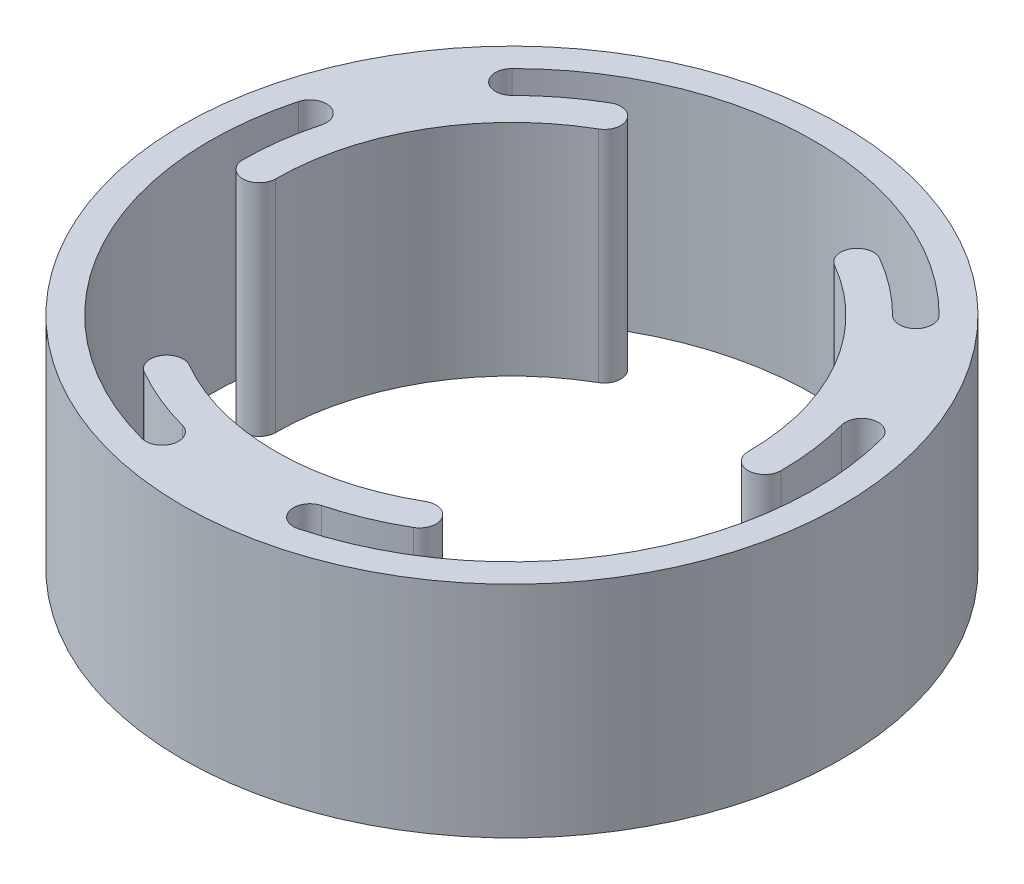
ISO-10303-21;
HEADER;
FILE_DESCRIPTION(('STEP AP214'),'2;1');
FILE_NAME('part.step','',(''),(''),'','','');
FILE_SCHEMA(('AUTOMOTIVE_DESIGN { 1 0 10303 214 1 1 1 1 }'));
ENDSEC;
DATA;
#1=APPLICATION_CONTEXT('core data for automotive mechanical design processes');
#2=APPLICATION_PROTOCOL_DEFINITION('international standard','automotive_design',2000,#1);
#3=PRODUCT_CONTEXT('',#1,'mechanical');
#4=PRODUCT('Part','Part','',(#3));
#5=PRODUCT_RELATED_PRODUCT_CATEGORY('part','',(#4));
#6=PRODUCT_DEFINITION_FORMATION('','',#4);
#7=PRODUCT_DEFINITION_CONTEXT('part definition',#1,'design');
#8=PRODUCT_DEFINITION('design','',#6,#7);
#9=PRODUCT_DEFINITION_SHAPE('','',#8);
#10=(LENGTH_UNIT() NAMED_UNIT(*) SI_UNIT(.MILLI.,.METRE.));
#11=(NAMED_UNIT(*) PLANE_ANGLE_UNIT() SI_UNIT($,.RADIAN.));
#12=(NAMED_UNIT(*) SI_UNIT($,.STERADIAN.) SOLID_ANGLE_UNIT());
#13=UNCERTAINTY_MEASURE_WITH_UNIT(LENGTH_MEASURE(1.E-05),#10,'distance_accuracy_value','');
#14=(GEOMETRIC_REPRESENTATION_CONTEXT(3) GLOBAL_UNCERTAINTY_ASSIGNED_CONTEXT((#13)) GLOBAL_UNIT_ASSIGNED_CONTEXT((#10,
#11,#12)) REPRESENTATION_CONTEXT('',''));
#15=CARTESIAN_POINT('',(0.,0.,0.));
#16=DIRECTION('',(0.,0.,1.));
#17=DIRECTION('',(1.,0.,0.));
#18=AXIS2_PLACEMENT_3D('',#15,#16,#17);
#19=CARTESIAN_POINT('',(0.,0.,0.));
#20=DIRECTION('',(0.,1.,0.));
#21=DIRECTION('',(0.,0.,1.));
#22=AXIS2_PLACEMENT_3D('',#19,#20,#21);
#23=PLANE('',#22);
#24=CARTESIAN_POINT('',(0.,0.,0.));
#25=DIRECTION('',(0.,1.,0.));
#26=DIRECTION('',(0.,0.,1.));
#27=AXIS2_PLACEMENT_3D('',#24,#25,#26);
#28=CIRCLE('',#27,30.);
#29=CARTESIAN_POINT('',(0.,0.,30.));
#30=VERTEX_POINT('',#29);
#31=EDGE_CURVE('E41',#30,#30,#28,.T.);
#32=ORIENTED_EDGE('',*,*,#31,.F.);
#33=EDGE_LOOP('',(#32));
#34=FACE_BOUND('',#33,.T.);
#35=CARTESIAN_POINT('',(18.3847763108503,0.,-18.3847763108502));
#36=DIRECTION('',(0.,1.,0.));
#37=DIRECTION('',(0.,0.,1.));
#38=AXIS2_PLACEMENT_3D('',#35,#36,#37);
#39=CIRCLE('',#38,1.5);
#40=CARTESIAN_POINT('',(19.4454364826301,0.,-19.44543648263));
#41=VERTEX_POINT('',#40);
#42=CARTESIAN_POINT('',(17.3241161390705,0.,-17.3241161390704));
#43=VERTEX_POINT('',#42);
#44=EDGE_CURVE('E267',#41,#43,#39,.F.);
#45=ORIENTED_EDGE('',*,*,#44,.F.);
#46=CARTESIAN_POINT('',(0.,0.,0.));
#47=DIRECTION('',(0.,1.,0.));
#48=DIRECTION('',(0.,0.,1.));
#49=AXIS2_PLACEMENT_3D('',#46,#47,#48);
#50=CIRCLE('',#49,27.5);
#51=CARTESIAN_POINT('',(-19.4454364826301,0.,-19.44543648263));
#52=VERTEX_POINT('',#51);
#53=EDGE_CURVE('E269',#52,#41,#50,.F.);
#54=ORIENTED_EDGE('',*,*,#53,.F.);
#55=CARTESIAN_POINT('',(-18.3847763108503,0.,-18.3847763108502));
#56=DIRECTION('',(0.,1.,0.));
#57=DIRECTION('',(0.,0.,1.));
#58=AXIS2_PLACEMENT_3D('',#55,#56,#57);
#59=CIRCLE('',#58,1.5);
#60=CARTESIAN_POINT('',(-17.3241161390705,0.,-17.3241161390704));
#61=VERTEX_POINT('',#60);
#62=EDGE_CURVE('E260',#61,#52,#59,.F.);
#63=ORIENTED_EDGE('',*,*,#62,.F.);
#64=CARTESIAN_POINT('',(0.,0.,0.));
#65=DIRECTION('',(0.,1.,0.));
#66=DIRECTION('',(0.,0.,1.));
#67=AXIS2_PLACEMENT_3D('',#64,#65,#66);
#68=CIRCLE('',#67,24.5);
#69=CARTESIAN_POINT('',(-12.2499999999999,0.,-21.2176223927188));
#70=VERTEX_POINT('',#69);
#71=EDGE_CURVE('E262',#70,#61,#68,.T.);
#72=ORIENTED_EDGE('',*,*,#71,.F.);
#73=CARTESIAN_POINT('',(-11.4999999999999,0.,-19.9185842870422));
#74=DIRECTION('',(0.,1.,0.));
#75=DIRECTION('',(0.,0.,1.));
#76=AXIS2_PLACEMENT_3D('',#73,#74,#75);
#77=CIRCLE('',#76,1.5);
#78=CARTESIAN_POINT('',(-10.7499999999999,0.,-18.6195461813655));
#79=VERTEX_POINT('',#78);
#80=EDGE_CURVE('E344',#79,#70,#77,.T.);
#81=ORIENTED_EDGE('',*,*,#80,.F.);
#82=CARTESIAN_POINT('',(0.,0.,0.));
#83=DIRECTION('',(0.,-1.,0.));
#84=DIRECTION('',(0.,0.,1.));
#85=AXIS2_PLACEMENT_3D('',#82,#83,#84);
#86=CIRCLE('',#85,21.5);
#87=CARTESIAN_POINT('',(-21.5,0.,-2.06291908745145E-13));
#88=VERTEX_POINT('',#87);
#89=EDGE_CURVE('E349',#88,#79,#86,.T.);
#90=ORIENTED_EDGE('',*,*,#89,.F.);
#91=CARTESIAN_POINT('',(-23.,0.,-2.21038701180133E-13));
#92=DIRECTION('',(0.,1.,0.));
#93=DIRECTION('',(0.,0.,1.));
#94=AXIS2_PLACEMENT_3D('',#91,#92,#93);
#95=CIRCLE('',#94,1.5);
#96=CARTESIAN_POINT('',(-24.5,0.,-2.35454268648402E-13));
#97=VERTEX_POINT('',#96);
#98=EDGE_CURVE('E222',#97,#88,#95,.T.);
#99=ORIENTED_EDGE('',*,*,#98,.F.);
#100=CARTESIAN_POINT('',(0.,0.,0.));
#101=DIRECTION('',(0.,1.,0.));
#102=DIRECTION('',(0.,0.,1.));
#103=AXIS2_PLACEMENT_3D('',#100,#101,#102);
#104=CIRCLE('',#103,24.5);
#105=CARTESIAN_POINT('',(-23.6651827440822,0.,-6.34106660501178));
#106=VERTEX_POINT('',#105);
#107=EDGE_CURVE('E212',#106,#97,#104,.T.);
#108=ORIENTED_EDGE('',*,*,#107,.F.);
#109=CARTESIAN_POINT('',(-25.1140714835158,0.,-6.72929517266559));
#110=DIRECTION('',(0.,1.,0.));
#111=DIRECTION('',(0.,0.,1.));
#112=AXIS2_PLACEMENT_3D('',#109,#110,#111);
#113=CIRCLE('',#112,1.5);
#114=CARTESIAN_POINT('',(-26.5629602229494,0.,-7.11752374031936));
#115=VERTEX_POINT('',#114);
#116=EDGE_CURVE('E198',#115,#106,#113,.F.);
#117=ORIENTED_EDGE('',*,*,#116,.F.);
#118=CARTESIAN_POINT('',(0.,0.,0.));
#119=DIRECTION('',(0.,1.,0.));
#120=DIRECTION('',(0.,0.,1.));
#121=AXIS2_PLACEMENT_3D('',#118,#119,#120);
#122=CIRCLE('',#121,27.5);
#123=CARTESIAN_POINT('',(-7.11752374031927,0.,26.5629602229494));
#124=VERTEX_POINT('',#123);
#125=EDGE_CURVE('E207',#124,#115,#122,.F.);
#126=ORIENTED_EDGE('',*,*,#125,.F.);
#127=CARTESIAN_POINT('',(-6.7292951726655,0.,25.1140714835158));
#128=DIRECTION('',(0.,1.,0.));
#129=DIRECTION('',(0.,0.,1.));
#130=AXIS2_PLACEMENT_3D('',#127,#128,#129);
#131=CIRCLE('',#130,1.5);
#132=CARTESIAN_POINT('',(-6.34106660501165,0.,23.6651827440822));
#133=VERTEX_POINT('',#132);
#134=EDGE_CURVE('E217',#133,#124,#131,.F.);
#135=ORIENTED_EDGE('',*,*,#134,.F.);
#136=CARTESIAN_POINT('',(-12.2500000000001,0.,21.2176223927187));
#137=VERTEX_POINT('',#136);
#138=EDGE_CURVE('E206',#137,#133,#104,.T.);
#139=ORIENTED_EDGE('',*,*,#138,.F.);
#140=CARTESIAN_POINT('',(-11.5000000000001,0.,19.918584287042));
#141=DIRECTION('',(0.,1.,0.));
#142=DIRECTION('',(0.,0.,1.));
#143=AXIS2_PLACEMENT_3D('',#140,#141,#142);
#144=CIRCLE('',#143,1.5);
#145=CARTESIAN_POINT('',(-10.7500000000001,0.,18.6195461813654));
#146=VERTEX_POINT('',#145);
#147=EDGE_CURVE('E332',#146,#137,#144,.T.);
#148=ORIENTED_EDGE('',*,*,#147,.F.);
#149=CARTESIAN_POINT('',(0.,0.,0.));
#150=DIRECTION('',(0.,-1.,0.));
#151=DIRECTION('',(0.,0.,1.));
#152=AXIS2_PLACEMENT_3D('',#149,#150,#151);
#153=CIRCLE('',#152,21.5);
#154=CARTESIAN_POINT('',(10.7499999999998,0.,18.6195461813655));
#155=VERTEX_POINT('',#154);
#156=EDGE_CURVE('E322',#155,#146,#153,.T.);
#157=ORIENTED_EDGE('',*,*,#156,.F.);
#158=CARTESIAN_POINT('',(11.4999999999998,0.,19.9185842870422));
#159=DIRECTION('',(0.,1.,0.));
#160=DIRECTION('',(0.,0.,1.));
#161=AXIS2_PLACEMENT_3D('',#158,#159,#160);
#162=CIRCLE('',#161,1.5);
#163=CARTESIAN_POINT('',(12.2499999999998,0.,21.2176223927189));
#164=VERTEX_POINT('',#163);
#165=EDGE_CURVE('E339',#164,#155,#162,.T.);
#166=ORIENTED_EDGE('',*,*,#165,.F.);
#167=CARTESIAN_POINT('',(0.,0.,0.));
#168=DIRECTION('',(0.,1.,0.));
#169=DIRECTION('',(0.,0.,1.));
#170=AXIS2_PLACEMENT_3D('',#167,#168,#169);
#171=CIRCLE('',#170,24.5);
#172=CARTESIAN_POINT('',(6.34106660501176,0.,23.6651827440822));
#173=VERTEX_POINT('',#172);
#174=EDGE_CURVE('E256',#173,#164,#171,.T.);
#175=ORIENTED_EDGE('',*,*,#174,.F.);
#176=CARTESIAN_POINT('',(6.7292951726655,0.,25.1140714835158));
#177=DIRECTION('',(0.,1.,0.));
#178=DIRECTION('',(0.,0.,1.));
#179=AXIS2_PLACEMENT_3D('',#176,#177,#178);
#180=CIRCLE('',#179,1.5);
#181=CARTESIAN_POINT('',(7.11752374031928,0.,26.5629602229494));
#182=VERTEX_POINT('',#181);
#183=EDGE_CURVE('E229',#182,#173,#180,.F.);
#184=ORIENTED_EDGE('',*,*,#183,.F.);
#185=CARTESIAN_POINT('',(0.,0.,0.));
#186=DIRECTION('',(0.,1.,0.));
#187=DIRECTION('',(0.,0.,1.));
#188=AXIS2_PLACEMENT_3D('',#185,#186,#187);
#189=CIRCLE('',#188,27.5);
#190=CARTESIAN_POINT('',(26.5629602229494,0.,-7.11752374031937));
#191=VERTEX_POINT('',#190);
#192=EDGE_CURVE('E227',#191,#182,#189,.F.);
#193=ORIENTED_EDGE('',*,*,#192,.F.);
#194=CARTESIAN_POINT('',(25.1140714835158,0.,-6.72929517266559));
#195=DIRECTION('',(0.,1.,0.));
#196=DIRECTION('',(0.,0.,1.));
#197=AXIS2_PLACEMENT_3D('',#194,#195,#196);
#198=CIRCLE('',#197,1.5);
#199=CARTESIAN_POINT('',(23.6651827440822,0.,-6.34106660501185));
#200=VERTEX_POINT('',#199);
#201=EDGE_CURVE('E240',#200,#191,#198,.F.);
#202=ORIENTED_EDGE('',*,*,#201,.F.);
#203=CARTESIAN_POINT('',(24.5,0.,1.33219235306974E-13));
#204=VERTEX_POINT('',#203);
#205=EDGE_CURVE('E255',#204,#200,#171,.T.);
#206=ORIENTED_EDGE('',*,*,#205,.F.);
#207=CARTESIAN_POINT('',(23.,0.,1.25062955594302E-13));
#208=DIRECTION('',(0.,1.,0.));
#209=DIRECTION('',(0.,0.,1.));
#210=AXIS2_PLACEMENT_3D('',#207,#208,#209);
#211=CIRCLE('',#210,1.5);
#212=CARTESIAN_POINT('',(21.5,0.,1.158915114504E-13));
#213=VERTEX_POINT('',#212);
#214=EDGE_CURVE('E306',#213,#204,#211,.T.);
#215=ORIENTED_EDGE('',*,*,#214,.F.);
#216=CARTESIAN_POINT('',(0.,0.,0.));
#217=DIRECTION('',(0.,-1.,0.));
#218=DIRECTION('',(0.,0.,1.));
#219=AXIS2_PLACEMENT_3D('',#216,#217,#218);
#220=CIRCLE('',#219,21.5);
#221=CARTESIAN_POINT('',(10.7500000000002,0.,-18.6195461813653));
#222=VERTEX_POINT('',#221);
#223=EDGE_CURVE('E294',#222,#213,#220,.T.);
#224=ORIENTED_EDGE('',*,*,#223,.F.);
#225=CARTESIAN_POINT('',(11.5000000000002,0.,-19.918584287042));
#226=DIRECTION('',(0.,1.,0.));
#227=DIRECTION('',(0.,0.,1.));
#228=AXIS2_PLACEMENT_3D('',#225,#226,#227);
#229=CIRCLE('',#228,1.5);
#230=CARTESIAN_POINT('',(12.2500000000002,0.,-21.2176223927186));
#231=VERTEX_POINT('',#230);
#232=EDGE_CURVE('E315',#231,#222,#229,.T.);
#233=ORIENTED_EDGE('',*,*,#232,.F.);
#234=EDGE_CURVE('E264',#43,#231,#68,.T.);
#235=ORIENTED_EDGE('',*,*,#234,.F.);
#236=EDGE_LOOP('',(#45,#54,#63,#72,#81,#90,#99,#108,#117,#126,#135,#139,#148,#157,#166,#175,
#184,#193,#202,#206,#215,#224,#233,#235));
#237=FACE_BOUND('',#236,.T.);
#238=ADVANCED_FACE('F37',(#34,#237),#23,.F.);
#239=CARTESIAN_POINT('',(0.,20.,0.));
#240=DIRECTION('',(0.,1.,0.));
#241=DIRECTION('',(0.,0.,1.));
#242=AXIS2_PLACEMENT_3D('',#239,#240,#241);
#243=PLANE('',#242);
#244=CARTESIAN_POINT('',(0.,20.,0.));
#245=DIRECTION('',(0.,-1.,0.));
#246=DIRECTION('',(0.,0.,1.));
#247=AXIS2_PLACEMENT_3D('',#244,#245,#246);
#248=CIRCLE('',#247,24.5);
#249=CARTESIAN_POINT('',(-17.3241161390705,20.,-17.3241161390704));
#250=VERTEX_POINT('',#249);
#251=CARTESIAN_POINT('',(-12.2499999999999,20.,-21.2176223927188));
#252=VERTEX_POINT('',#251);
#253=EDGE_CURVE('E279',#250,#252,#248,.T.);
#254=ORIENTED_EDGE('',*,*,#253,.F.);
#255=CARTESIAN_POINT('',(-18.3847763108503,20.,-18.3847763108502));
#256=DIRECTION('',(0.,1.,0.));
#257=DIRECTION('',(0.,0.,1.));
#258=AXIS2_PLACEMENT_3D('',#255,#256,#257);
#259=CIRCLE('',#258,1.5);
#260=CARTESIAN_POINT('',(-19.4454364826301,20.,-19.44543648263));
#261=VERTEX_POINT('',#260);
#262=EDGE_CURVE('E275',#261,#250,#259,.T.);
#263=ORIENTED_EDGE('',*,*,#262,.F.);
#264=CARTESIAN_POINT('',(0.,20.,0.));
#265=DIRECTION('',(0.,1.,0.));
#266=DIRECTION('',(0.,0.,1.));
#267=AXIS2_PLACEMENT_3D('',#264,#265,#266);
#268=CIRCLE('',#267,27.5);
#269=CARTESIAN_POINT('',(19.4454364826301,20.,-19.44543648263));
#270=VERTEX_POINT('',#269);
#271=EDGE_CURVE('E272',#270,#261,#268,.T.);
#272=ORIENTED_EDGE('',*,*,#271,.F.);
#273=CARTESIAN_POINT('',(18.3847763108503,20.,-18.3847763108502));
#274=DIRECTION('',(0.,1.,0.));
#275=DIRECTION('',(0.,0.,1.));
#276=AXIS2_PLACEMENT_3D('',#273,#274,#275);
#277=CIRCLE('',#276,1.5);
#278=CARTESIAN_POINT('',(17.3241161390705,20.,-17.3241161390704));
#279=VERTEX_POINT('',#278);
#280=EDGE_CURVE('E253',#279,#270,#277,.T.);
#281=ORIENTED_EDGE('',*,*,#280,.F.);
#282=CARTESIAN_POINT('',(12.2500000000002,20.,-21.2176223927186));
#283=VERTEX_POINT('',#282);
#284=EDGE_CURVE('E278',#283,#279,#248,.T.);
#285=ORIENTED_EDGE('',*,*,#284,.F.);
#286=CARTESIAN_POINT('',(11.5000000000002,20.,-19.918584287042));
#287=DIRECTION('',(0.,1.,0.));
#288=DIRECTION('',(0.,0.,1.));
#289=AXIS2_PLACEMENT_3D('',#286,#287,#288);
#290=CIRCLE('',#289,1.5);
#291=CARTESIAN_POINT('',(10.7500000000002,20.,-18.6195461813653));
#292=VERTEX_POINT('',#291);
#293=EDGE_CURVE('E305',#283,#292,#290,.T.);
#294=ORIENTED_EDGE('',*,*,#293,.T.);
#295=CARTESIAN_POINT('',(0.,20.,0.));
#296=DIRECTION('',(0.,-1.,0.));
#297=DIRECTION('',(0.,0.,1.));
#298=AXIS2_PLACEMENT_3D('',#295,#296,#297);
#299=CIRCLE('',#298,21.5);
#300=CARTESIAN_POINT('',(21.5,20.,1.158915114504E-13));
#301=VERTEX_POINT('',#300);
#302=EDGE_CURVE('E302',#292,#301,#299,.T.);
#303=ORIENTED_EDGE('',*,*,#302,.T.);
#304=CARTESIAN_POINT('',(23.,20.,1.25062955594302E-13));
#305=DIRECTION('',(0.,1.,0.));
#306=DIRECTION('',(0.,0.,1.));
#307=AXIS2_PLACEMENT_3D('',#304,#305,#306);
#308=CIRCLE('',#307,1.5);
#309=CARTESIAN_POINT('',(24.5,20.,1.33219235306974E-13));
#310=VERTEX_POINT('',#309);
#311=EDGE_CURVE('E309',#301,#310,#308,.T.);
#312=ORIENTED_EDGE('',*,*,#311,.T.);
#313=CARTESIAN_POINT('',(0.,20.,0.));
#314=DIRECTION('',(0.,-1.,0.));
#315=DIRECTION('',(0.,0.,1.));
#316=AXIS2_PLACEMENT_3D('',#313,#314,#315);
#317=CIRCLE('',#316,24.5);
#318=CARTESIAN_POINT('',(23.6651827440822,20.,-6.34106660501185));
#319=VERTEX_POINT('',#318);
#320=EDGE_CURVE('E241',#319,#310,#317,.T.);
#321=ORIENTED_EDGE('',*,*,#320,.F.);
#322=CARTESIAN_POINT('',(25.1140714835158,20.,-6.72929517266559));
#323=DIRECTION('',(0.,1.,0.));
#324=DIRECTION('',(0.,0.,1.));
#325=AXIS2_PLACEMENT_3D('',#322,#323,#324);
#326=CIRCLE('',#325,1.5);
#327=CARTESIAN_POINT('',(26.5629602229494,20.,-7.11752374031937));
#328=VERTEX_POINT('',#327);
#329=EDGE_CURVE('E244',#328,#319,#326,.T.);
#330=ORIENTED_EDGE('',*,*,#329,.F.);
#331=CARTESIAN_POINT('',(0.,20.,0.));
#332=DIRECTION('',(0.,1.,0.));
#333=DIRECTION('',(0.,0.,1.));
#334=AXIS2_PLACEMENT_3D('',#331,#332,#333);
#335=CIRCLE('',#334,27.5);
#336=CARTESIAN_POINT('',(7.11752374031928,20.,26.5629602229494));
#337=VERTEX_POINT('',#336);
#338=EDGE_CURVE('E247',#337,#328,#335,.T.);
#339=ORIENTED_EDGE('',*,*,#338,.F.);
#340=CARTESIAN_POINT('',(6.7292951726655,20.,25.1140714835158));
#341=DIRECTION('',(0.,1.,0.));
#342=DIRECTION('',(0.,0.,1.));
#343=AXIS2_PLACEMENT_3D('',#340,#341,#342);
#344=CIRCLE('',#343,1.5);
#345=CARTESIAN_POINT('',(6.34106660501176,20.,23.6651827440822));
#346=VERTEX_POINT('',#345);
#347=EDGE_CURVE('E250',#346,#337,#344,.T.);
#348=ORIENTED_EDGE('',*,*,#347,.F.);
#349=CARTESIAN_POINT('',(12.2499999999998,20.,21.2176223927189));
#350=VERTEX_POINT('',#349);
#351=EDGE_CURVE('E232',#350,#346,#317,.T.);
#352=ORIENTED_EDGE('',*,*,#351,.F.);
#353=CARTESIAN_POINT('',(11.4999999999998,20.,19.9185842870422));
#354=DIRECTION('',(0.,1.,0.));
#355=DIRECTION('',(0.,0.,1.));
#356=AXIS2_PLACEMENT_3D('',#353,#354,#355);
#357=CIRCLE('',#356,1.5);
#358=CARTESIAN_POINT('',(10.7499999999998,20.,18.6195461813655));
#359=VERTEX_POINT('',#358);
#360=EDGE_CURVE('E331',#350,#359,#357,.T.);
#361=ORIENTED_EDGE('',*,*,#360,.T.);
#362=CARTESIAN_POINT('',(0.,20.,0.));
#363=DIRECTION('',(0.,-1.,0.));
#364=DIRECTION('',(0.,0.,1.));
#365=AXIS2_PLACEMENT_3D('',#362,#363,#364);
#366=CIRCLE('',#365,21.5);
#367=CARTESIAN_POINT('',(-10.7500000000001,20.,18.6195461813654));
#368=VERTEX_POINT('',#367);
#369=EDGE_CURVE('E328',#359,#368,#366,.T.);
#370=ORIENTED_EDGE('',*,*,#369,.T.);
#371=CARTESIAN_POINT('',(-11.5000000000001,20.,19.918584287042));
#372=DIRECTION('',(0.,1.,0.));
#373=DIRECTION('',(0.,0.,1.));
#374=AXIS2_PLACEMENT_3D('',#371,#372,#373);
#375=CIRCLE('',#374,1.5);
#376=CARTESIAN_POINT('',(-12.2500000000001,20.,21.2176223927187));
#377=VERTEX_POINT('',#376);
#378=EDGE_CURVE('E301',#368,#377,#375,.T.);
#379=ORIENTED_EDGE('',*,*,#378,.T.);
#380=CARTESIAN_POINT('',(0.,20.,0.));
#381=DIRECTION('',(0.,-1.,0.));
#382=DIRECTION('',(0.,0.,1.));
#383=AXIS2_PLACEMENT_3D('',#380,#381,#382);
#384=CIRCLE('',#383,24.5);
#385=CARTESIAN_POINT('',(-6.34106660501165,20.,23.6651827440822));
#386=VERTEX_POINT('',#385);
#387=EDGE_CURVE('E448',#386,#377,#384,.T.);
#388=ORIENTED_EDGE('',*,*,#387,.F.);
#389=CARTESIAN_POINT('',(-6.7292951726655,20.,25.1140714835158));
#390=DIRECTION('',(0.,1.,0.));
#391=DIRECTION('',(0.,0.,1.));
#392=AXIS2_PLACEMENT_3D('',#389,#390,#391);
#393=CIRCLE('',#392,1.5);
#394=CARTESIAN_POINT('',(-7.11752374031927,20.,26.5629602229494));
#395=VERTEX_POINT('',#394);
#396=EDGE_CURVE('E457',#395,#386,#393,.T.);
#397=ORIENTED_EDGE('',*,*,#396,.F.);
#398=CARTESIAN_POINT('',(0.,20.,0.));
#399=DIRECTION('',(0.,1.,0.));
#400=DIRECTION('',(0.,0.,1.));
#401=AXIS2_PLACEMENT_3D('',#398,#399,#400);
#402=CIRCLE('',#401,27.5);
#403=CARTESIAN_POINT('',(-26.5629602229494,20.,-7.11752374031937));
#404=VERTEX_POINT('',#403);
#405=EDGE_CURVE('E459',#404,#395,#402,.T.);
#406=ORIENTED_EDGE('',*,*,#405,.F.);
#407=CARTESIAN_POINT('',(-25.1140714835158,20.,-6.72929517266559));
#408=DIRECTION('',(0.,1.,0.));
#409=DIRECTION('',(0.,0.,1.));
#410=AXIS2_PLACEMENT_3D('',#407,#408,#409);
#411=CIRCLE('',#410,1.5);
#412=CARTESIAN_POINT('',(-23.6651827440822,20.,-6.34106660501178));
#413=VERTEX_POINT('',#412);
#414=EDGE_CURVE('E52',#413,#404,#411,.T.);
#415=ORIENTED_EDGE('',*,*,#414,.F.);
#416=CARTESIAN_POINT('',(-24.5,20.,-2.65625032378703E-13));
#417=VERTEX_POINT('',#416);
#418=EDGE_CURVE('E215',#417,#413,#384,.T.);
#419=ORIENTED_EDGE('',*,*,#418,.F.);
#420=CARTESIAN_POINT('',(-23.,20.,-2.21038701180133E-13));
#421=DIRECTION('',(0.,1.,0.));
#422=DIRECTION('',(0.,0.,1.));
#423=AXIS2_PLACEMENT_3D('',#420,#421,#422);
#424=CIRCLE('',#423,1.5);
#425=CARTESIAN_POINT('',(-21.5,20.,-2.06291908745145E-13));
#426=VERTEX_POINT('',#425);
#427=EDGE_CURVE('E355',#417,#426,#424,.T.);
#428=ORIENTED_EDGE('',*,*,#427,.T.);
#429=CARTESIAN_POINT('',(0.,20.,0.));
#430=DIRECTION('',(0.,-1.,0.));
#431=DIRECTION('',(0.,0.,1.));
#432=AXIS2_PLACEMENT_3D('',#429,#430,#431);
#433=CIRCLE('',#432,21.5);
#434=CARTESIAN_POINT('',(-10.7499999999999,20.,-18.6195461813655));
#435=VERTEX_POINT('',#434);
#436=EDGE_CURVE('E347',#426,#435,#433,.T.);
#437=ORIENTED_EDGE('',*,*,#436,.T.);
#438=CARTESIAN_POINT('',(-11.4999999999999,20.,-19.9185842870422));
#439=DIRECTION('',(0.,1.,0.));
#440=DIRECTION('',(0.,0.,1.));
#441=AXIS2_PLACEMENT_3D('',#438,#439,#440);
#442=CIRCLE('',#441,1.5);
#443=EDGE_CURVE('E312',#435,#252,#442,.T.);
#444=ORIENTED_EDGE('',*,*,#443,.T.);
#445=EDGE_LOOP('',(#254,#263,#272,#281,#285,#294,#303,#312,#321,#330,#339,#348,#352,#361,#370,
#379,#388,#397,#406,#415,#419,#428,#437,#444));
#446=FACE_BOUND('',#445,.T.);
#447=CARTESIAN_POINT('',(0.,20.,0.));
#448=DIRECTION('',(0.,1.,0.));
#449=DIRECTION('',(0.,0.,1.));
#450=AXIS2_PLACEMENT_3D('',#447,#448,#449);
#451=CIRCLE('',#450,30.);
#452=CARTESIAN_POINT('',(0.,20.,30.));
#453=VERTEX_POINT('',#452);
#454=EDGE_CURVE('E11',#453,#453,#451,.T.);
#455=ORIENTED_EDGE('',*,*,#454,.T.);
#456=EDGE_LOOP('',(#455));
#457=FACE_BOUND('',#456,.T.);
#458=ADVANCED_FACE('F377',(#446,#457),#243,.T.);
#459=CARTESIAN_POINT('',(0.,20.,0.));
#460=DIRECTION('',(0.,-1.,0.));
#461=DIRECTION('',(0.,0.,-1.));
#462=AXIS2_PLACEMENT_3D('',#459,#460,#461);
#463=CYLINDRICAL_SURFACE('',#462,30.);
#464=ORIENTED_EDGE('',*,*,#454,.F.);
#465=EDGE_LOOP('',(#464));
#466=FACE_BOUND('',#465,.T.);
#467=ORIENTED_EDGE('',*,*,#31,.T.);
#468=EDGE_LOOP('',(#467));
#469=FACE_BOUND('',#468,.T.);
#470=ADVANCED_FACE('F39',(#466,#469),#463,.T.);
#471=CARTESIAN_POINT('',(-11.4999999999999,0.,-19.9185842870422));
#472=DIRECTION('',(0.,1.,0.));
#473=DIRECTION('',(0.,0.,1.));
#474=AXIS2_PLACEMENT_3D('',#471,#472,#473);
#475=CYLINDRICAL_SURFACE('',#474,1.5);
#476=ORIENTED_EDGE('',*,*,#443,.F.);
#477=DIRECTION('',(0.,1.,0.));
#478=VECTOR('',#477,1.);
#479=CARTESIAN_POINT('',(-10.7499999999999,0.,-18.6195461813655));
#480=LINE('',#479,#478);
#481=EDGE_CURVE('E360',#79,#435,#480,.T.);
#482=ORIENTED_EDGE('',*,*,#481,.F.);
#483=ORIENTED_EDGE('',*,*,#80,.T.);
#484=DIRECTION('',(0.,1.,0.));
#485=VECTOR('',#484,1.);
#486=CARTESIAN_POINT('',(-12.2499999999999,0.,-21.2176223927188));
#487=LINE('',#486,#485);
#488=EDGE_CURVE('E352',#70,#252,#487,.T.);
#489=ORIENTED_EDGE('',*,*,#488,.T.);
#490=EDGE_LOOP('',(#476,#482,#483,#489));
#491=FACE_BOUND('',#490,.T.);
#492=ADVANCED_FACE('F368',(#491),#475,.T.);
#493=CARTESIAN_POINT('',(0.,0.,0.));
#494=DIRECTION('',(0.,1.,0.));
#495=DIRECTION('',(0.,0.,1.));
#496=AXIS2_PLACEMENT_3D('',#493,#494,#495);
#497=CYLINDRICAL_SURFACE('',#496,21.5);
#498=DIRECTION('',(0.,1.,0.));
#499=VECTOR('',#498,1.);
#500=CARTESIAN_POINT('',(-21.5,0.,-2.06291908745145E-13));
#501=LINE('',#500,#499);
#502=EDGE_CURVE('E362',#88,#426,#501,.T.);
#503=ORIENTED_EDGE('',*,*,#502,.F.);
#504=ORIENTED_EDGE('',*,*,#89,.T.);
#505=ORIENTED_EDGE('',*,*,#481,.T.);
#506=ORIENTED_EDGE('',*,*,#436,.F.);
#507=EDGE_LOOP('',(#503,#504,#505,#506));
#508=FACE_BOUND('',#507,.T.);
#509=ADVANCED_FACE('F382',(#508),#497,.F.);
#510=CARTESIAN_POINT('',(-23.,0.,-2.21038701180133E-13));
#511=DIRECTION('',(0.,1.,0.));
#512=DIRECTION('',(0.,0.,1.));
#513=AXIS2_PLACEMENT_3D('',#510,#511,#512);
#514=CYLINDRICAL_SURFACE('',#513,1.5);
#515=ORIENTED_EDGE('',*,*,#427,.F.);
#516=DIRECTION('',(0.,1.,0.));
#517=VECTOR('',#516,1.);
#518=CARTESIAN_POINT('',(-24.5,0.,-2.65625032378703E-13));
#519=LINE('',#518,#517);
#520=EDGE_CURVE('E364',#97,#417,#519,.T.);
#521=ORIENTED_EDGE('',*,*,#520,.F.);
#522=ORIENTED_EDGE('',*,*,#98,.T.);
#523=ORIENTED_EDGE('',*,*,#502,.T.);
#524=EDGE_LOOP('',(#515,#521,#522,#523));
#525=FACE_BOUND('',#524,.T.);
#526=ADVANCED_FACE('F490',(#525),#514,.T.);
#527=CARTESIAN_POINT('',(23.,0.,1.25062955594302E-13));
#528=DIRECTION('',(0.,1.,0.));
#529=DIRECTION('',(0.,0.,1.));
#530=AXIS2_PLACEMENT_3D('',#527,#528,#529);
#531=CYLINDRICAL_SURFACE('',#530,1.5);
#532=ORIENTED_EDGE('',*,*,#311,.F.);
#533=DIRECTION('',(0.,1.,0.));
#534=VECTOR('',#533,1.);
#535=CARTESIAN_POINT('',(21.5,0.,1.158915114504E-13));
#536=LINE('',#535,#534);
#537=EDGE_CURVE('E299',#213,#301,#536,.T.);
#538=ORIENTED_EDGE('',*,*,#537,.F.);
#539=ORIENTED_EDGE('',*,*,#214,.T.);
#540=DIRECTION('',(0.,1.,0.));
#541=VECTOR('',#540,1.);
#542=CARTESIAN_POINT('',(24.5,0.,1.21182234383547E-13));
#543=LINE('',#542,#541);
#544=EDGE_CURVE('E292',#204,#310,#543,.T.);
#545=ORIENTED_EDGE('',*,*,#544,.T.);
#546=EDGE_LOOP('',(#532,#538,#539,#545));
#547=FACE_BOUND('',#546,.T.);
#548=ADVANCED_FACE('F412',(#547),#531,.T.);
#549=CARTESIAN_POINT('',(0.,0.,0.));
#550=DIRECTION('',(0.,1.,0.));
#551=DIRECTION('',(0.,0.,1.));
#552=AXIS2_PLACEMENT_3D('',#549,#550,#551);
#553=CYLINDRICAL_SURFACE('',#552,21.5);
#554=DIRECTION('',(0.,1.,0.));
#555=VECTOR('',#554,1.);
#556=CARTESIAN_POINT('',(10.7500000000002,0.,-18.6195461813653));
#557=LINE('',#556,#555);
#558=EDGE_CURVE('E297',#222,#292,#557,.T.);
#559=ORIENTED_EDGE('',*,*,#558,.F.);
#560=ORIENTED_EDGE('',*,*,#223,.T.);
#561=ORIENTED_EDGE('',*,*,#537,.T.);
#562=ORIENTED_EDGE('',*,*,#302,.F.);
#563=EDGE_LOOP('',(#559,#560,#561,#562));
#564=FACE_BOUND('',#563,.T.);
#565=ADVANCED_FACE('F410',(#564),#553,.F.);
#566=CARTESIAN_POINT('',(11.5000000000002,0.,-19.918584287042));
#567=DIRECTION('',(0.,1.,0.));
#568=DIRECTION('',(0.,0.,1.));
#569=AXIS2_PLACEMENT_3D('',#566,#567,#568);
#570=CYLINDRICAL_SURFACE('',#569,1.5);
#571=ORIENTED_EDGE('',*,*,#293,.F.);
#572=DIRECTION('',(0.,1.,0.));
#573=VECTOR('',#572,1.);
#574=CARTESIAN_POINT('',(12.2500000000002,0.,-21.2176223927186));
#575=LINE('',#574,#573);
#576=EDGE_CURVE('E295',#231,#283,#575,.T.);
#577=ORIENTED_EDGE('',*,*,#576,.F.);
#578=ORIENTED_EDGE('',*,*,#232,.T.);
#579=ORIENTED_EDGE('',*,*,#558,.T.);
#580=EDGE_LOOP('',(#571,#577,#578,#579));
#581=FACE_BOUND('',#580,.T.);
#582=ADVANCED_FACE('F405',(#581),#570,.T.);
#583=CARTESIAN_POINT('',(-11.5000000000001,0.,19.918584287042));
#584=DIRECTION('',(0.,1.,0.));
#585=DIRECTION('',(0.,0.,1.));
#586=AXIS2_PLACEMENT_3D('',#583,#584,#585);
#587=CYLINDRICAL_SURFACE('',#586,1.5);
#588=ORIENTED_EDGE('',*,*,#378,.F.);
#589=DIRECTION('',(0.,1.,0.));
#590=VECTOR('',#589,1.);
#591=CARTESIAN_POINT('',(-10.7500000000001,0.,18.6195461813654));
#592=LINE('',#591,#590);
#593=EDGE_CURVE('E291',#146,#368,#592,.T.);
#594=ORIENTED_EDGE('',*,*,#593,.F.);
#595=ORIENTED_EDGE('',*,*,#147,.T.);
#596=DIRECTION('',(0.,1.,0.));
#597=VECTOR('',#596,1.);
#598=CARTESIAN_POINT('',(-12.2500000000001,0.,21.2176223927187));
#599=LINE('',#598,#597);
#600=EDGE_CURVE('E320',#137,#377,#599,.T.);
#601=ORIENTED_EDGE('',*,*,#600,.T.);
#602=EDGE_LOOP('',(#588,#594,#595,#601));
#603=FACE_BOUND('',#602,.T.);
#604=ADVANCED_FACE('F450',(#603),#587,.T.);
#605=CARTESIAN_POINT('',(0.,0.,0.));
#606=DIRECTION('',(0.,1.,0.));
#607=DIRECTION('',(0.,0.,1.));
#608=AXIS2_PLACEMENT_3D('',#605,#606,#607);
#609=CYLINDRICAL_SURFACE('',#608,21.5);
#610=DIRECTION('',(0.,1.,0.));
#611=VECTOR('',#610,1.);
#612=CARTESIAN_POINT('',(10.7499999999998,0.,18.6195461813655));
#613=LINE('',#612,#611);
#614=EDGE_CURVE('E325',#155,#359,#613,.T.);
#615=ORIENTED_EDGE('',*,*,#614,.F.);
#616=ORIENTED_EDGE('',*,*,#156,.T.);
#617=ORIENTED_EDGE('',*,*,#593,.T.);
#618=ORIENTED_EDGE('',*,*,#369,.F.);
#619=EDGE_LOOP('',(#615,#616,#617,#618));
#620=FACE_BOUND('',#619,.T.);
#621=ADVANCED_FACE('F443',(#620),#609,.F.);
#622=CARTESIAN_POINT('',(11.4999999999998,0.,19.9185842870422));
#623=DIRECTION('',(0.,1.,0.));
#624=DIRECTION('',(0.,0.,1.));
#625=AXIS2_PLACEMENT_3D('',#622,#623,#624);
#626=CYLINDRICAL_SURFACE('',#625,1.5);
#627=ORIENTED_EDGE('',*,*,#360,.F.);
#628=DIRECTION('',(0.,1.,0.));
#629=VECTOR('',#628,1.);
#630=CARTESIAN_POINT('',(12.2499999999998,0.,21.2176223927189));
#631=LINE('',#630,#629);
#632=EDGE_CURVE('E323',#164,#350,#631,.T.);
#633=ORIENTED_EDGE('',*,*,#632,.F.);
#634=ORIENTED_EDGE('',*,*,#165,.T.);
#635=ORIENTED_EDGE('',*,*,#614,.T.);
#636=EDGE_LOOP('',(#627,#633,#634,#635));
#637=FACE_BOUND('',#636,.T.);
#638=ADVANCED_FACE('F439',(#637),#626,.T.);
#639=CARTESIAN_POINT('',(0.,-41.3526842350452,0.));
#640=DIRECTION('',(0.,1.,0.));
#641=DIRECTION('',(0.,0.,1.));
#642=AXIS2_PLACEMENT_3D('',#639,#640,#641);
#643=CYLINDRICAL_SURFACE('',#642,24.5);
#644=ORIENTED_EDGE('',*,*,#576,.T.);
#645=ORIENTED_EDGE('',*,*,#284,.T.);
#646=DIRECTION('',(0.,1.,0.));
#647=VECTOR('',#646,1.);
#648=CARTESIAN_POINT('',(17.3241161390705,-41.3526842350452,-17.3241161390704));
#649=LINE('',#648,#647);
#650=EDGE_CURVE('E263',#43,#279,#649,.T.);
#651=ORIENTED_EDGE('',*,*,#650,.F.);
#652=ORIENTED_EDGE('',*,*,#234,.T.);
#653=EDGE_LOOP('',(#644,#645,#651,#652));
#654=FACE_BOUND('',#653,.T.);
#655=ADVANCED_FACE('F399',(#654),#643,.T.);
#656=CARTESIAN_POINT('',(18.3847763108503,-41.3526842350452,-18.3847763108502));
#657=DIRECTION('',(0.,1.,0.));
#658=DIRECTION('',(0.,0.,1.));
#659=AXIS2_PLACEMENT_3D('',#656,#657,#658);
#660=CYLINDRICAL_SURFACE('',#659,1.5);
#661=ORIENTED_EDGE('',*,*,#44,.T.);
#662=ORIENTED_EDGE('',*,*,#650,.T.);
#663=ORIENTED_EDGE('',*,*,#280,.T.);
#664=DIRECTION('',(0.,1.,0.));
#665=VECTOR('',#664,1.);
#666=CARTESIAN_POINT('',(19.4454364826301,-41.3526842350452,-19.44543648263));
#667=LINE('',#666,#665);
#668=EDGE_CURVE('E282',#41,#270,#667,.T.);
#669=ORIENTED_EDGE('',*,*,#668,.F.);
#670=EDGE_LOOP('',(#661,#662,#663,#669));
#671=FACE_BOUND('',#670,.T.);
#672=ADVANCED_FACE('F395',(#671),#660,.F.);
#673=ORIENTED_EDGE('',*,*,#71,.T.);
#674=DIRECTION('',(0.,1.,0.));
#675=VECTOR('',#674,1.);
#676=CARTESIAN_POINT('',(-17.3241161390705,-41.3526842350452,-17.3241161390704));
#677=LINE('',#676,#675);
#678=EDGE_CURVE('E285',#61,#250,#677,.T.);
#679=ORIENTED_EDGE('',*,*,#678,.T.);
#680=ORIENTED_EDGE('',*,*,#253,.T.);
#681=ORIENTED_EDGE('',*,*,#488,.F.);
#682=EDGE_LOOP('',(#673,#679,#680,#681));
#683=FACE_BOUND('',#682,.T.);
#684=ADVANCED_FACE('F373',(#683),#643,.T.);
#685=CARTESIAN_POINT('',(-18.3847763108503,-41.3526842350452,-18.3847763108502));
#686=DIRECTION('',(0.,1.,0.));
#687=DIRECTION('',(0.,0.,1.));
#688=AXIS2_PLACEMENT_3D('',#685,#686,#687);
#689=CYLINDRICAL_SURFACE('',#688,1.5);
#690=ORIENTED_EDGE('',*,*,#62,.T.);
#691=DIRECTION('',(0.,1.,0.));
#692=VECTOR('',#691,1.);
#693=CARTESIAN_POINT('',(-19.4454364826301,-41.3526842350452,-19.44543648263));
#694=LINE('',#693,#692);
#695=EDGE_CURVE('E287',#52,#261,#694,.T.);
#696=ORIENTED_EDGE('',*,*,#695,.T.);
#697=ORIENTED_EDGE('',*,*,#262,.T.);
#698=ORIENTED_EDGE('',*,*,#678,.F.);
#699=EDGE_LOOP('',(#690,#696,#697,#698));
#700=FACE_BOUND('',#699,.T.);
#701=ADVANCED_FACE('F386',(#700),#689,.F.);
#702=CARTESIAN_POINT('',(0.,-41.3526842350452,0.));
#703=DIRECTION('',(0.,1.,0.));
#704=DIRECTION('',(0.,0.,1.));
#705=AXIS2_PLACEMENT_3D('',#702,#703,#704);
#706=CYLINDRICAL_SURFACE('',#705,27.5);
#707=ORIENTED_EDGE('',*,*,#53,.T.);
#708=ORIENTED_EDGE('',*,*,#668,.T.);
#709=ORIENTED_EDGE('',*,*,#271,.T.);
#710=ORIENTED_EDGE('',*,*,#695,.F.);
#711=EDGE_LOOP('',(#707,#708,#709,#710));
#712=FACE_BOUND('',#711,.T.);
#713=ADVANCED_FACE('F392',(#712),#706,.F.);
#714=CARTESIAN_POINT('',(0.,-41.3526842350452,0.));
#715=DIRECTION('',(0.,1.,0.));
#716=DIRECTION('',(0.,0.,1.));
#717=AXIS2_PLACEMENT_3D('',#714,#715,#716);
#718=CYLINDRICAL_SURFACE('',#717,24.5);
#719=ORIENTED_EDGE('',*,*,#632,.T.);
#720=ORIENTED_EDGE('',*,*,#351,.T.);
#721=DIRECTION('',(0.,1.,0.));
#722=VECTOR('',#721,1.);
#723=CARTESIAN_POINT('',(6.34106660501176,-41.3526842350452,23.6651827440822));
#724=LINE('',#723,#722);
#725=EDGE_CURVE('E237',#173,#346,#724,.T.);
#726=ORIENTED_EDGE('',*,*,#725,.F.);
#727=ORIENTED_EDGE('',*,*,#174,.T.);
#728=EDGE_LOOP('',(#719,#720,#726,#727));
#729=FACE_BOUND('',#728,.T.);
#730=ADVANCED_FACE('F435',(#729),#718,.T.);
#731=CARTESIAN_POINT('',(6.7292951726655,-41.3526842350452,25.1140714835158));
#732=DIRECTION('',(0.,1.,0.));
#733=DIRECTION('',(0.,0.,1.));
#734=AXIS2_PLACEMENT_3D('',#731,#732,#733);
#735=CYLINDRICAL_SURFACE('',#734,1.5);
#736=ORIENTED_EDGE('',*,*,#183,.T.);
#737=ORIENTED_EDGE('',*,*,#725,.T.);
#738=ORIENTED_EDGE('',*,*,#347,.T.);
#739=DIRECTION('',(0.,1.,0.));
#740=VECTOR('',#739,1.);
#741=CARTESIAN_POINT('',(7.11752374031928,-41.3526842350452,26.5629602229494));
#742=LINE('',#741,#740);
#743=EDGE_CURVE('E230',#182,#337,#742,.T.);
#744=ORIENTED_EDGE('',*,*,#743,.F.);
#745=EDGE_LOOP('',(#736,#737,#738,#744));
#746=FACE_BOUND('',#745,.T.);
#747=ADVANCED_FACE('F430',(#746),#735,.F.);
#748=ORIENTED_EDGE('',*,*,#205,.T.);
#749=DIRECTION('',(0.,1.,0.));
#750=VECTOR('',#749,1.);
#751=CARTESIAN_POINT('',(23.6651827440822,-41.3526842350452,-6.34106660501185));
#752=LINE('',#751,#750);
#753=EDGE_CURVE('E235',#200,#319,#752,.T.);
#754=ORIENTED_EDGE('',*,*,#753,.T.);
#755=ORIENTED_EDGE('',*,*,#320,.T.);
#756=ORIENTED_EDGE('',*,*,#544,.F.);
#757=EDGE_LOOP('',(#748,#754,#755,#756));
#758=FACE_BOUND('',#757,.T.);
#759=ADVANCED_FACE('F415',(#758),#718,.T.);
#760=CARTESIAN_POINT('',(25.1140714835158,-41.3526842350452,-6.72929517266559));
#761=DIRECTION('',(0.,1.,0.));
#762=DIRECTION('',(0.,0.,1.));
#763=AXIS2_PLACEMENT_3D('',#760,#761,#762);
#764=CYLINDRICAL_SURFACE('',#763,1.5);
#765=ORIENTED_EDGE('',*,*,#201,.T.);
#766=DIRECTION('',(0.,1.,0.));
#767=VECTOR('',#766,1.);
#768=CARTESIAN_POINT('',(26.5629602229494,-41.3526842350452,-7.11752374031937));
#769=LINE('',#768,#767);
#770=EDGE_CURVE('E233',#191,#328,#769,.T.);
#771=ORIENTED_EDGE('',*,*,#770,.T.);
#772=ORIENTED_EDGE('',*,*,#329,.T.);
#773=ORIENTED_EDGE('',*,*,#753,.F.);
#774=EDGE_LOOP('',(#765,#771,#772,#773));
#775=FACE_BOUND('',#774,.T.);
#776=ADVANCED_FACE('F421',(#775),#764,.F.);
#777=CARTESIAN_POINT('',(0.,-41.3526842350452,0.));
#778=DIRECTION('',(0.,1.,0.));
#779=DIRECTION('',(0.,0.,1.));
#780=AXIS2_PLACEMENT_3D('',#777,#778,#779);
#781=CYLINDRICAL_SURFACE('',#780,27.5);
#782=ORIENTED_EDGE('',*,*,#192,.T.);
#783=ORIENTED_EDGE('',*,*,#743,.T.);
#784=ORIENTED_EDGE('',*,*,#338,.T.);
#785=ORIENTED_EDGE('',*,*,#770,.F.);
#786=EDGE_LOOP('',(#782,#783,#784,#785));
#787=FACE_BOUND('',#786,.T.);
#788=ADVANCED_FACE('F426',(#787),#781,.F.);
#789=CARTESIAN_POINT('',(0.,-41.3526842350452,0.));
#790=DIRECTION('',(0.,1.,0.));
#791=DIRECTION('',(0.,0.,1.));
#792=AXIS2_PLACEMENT_3D('',#789,#790,#791);
#793=CYLINDRICAL_SURFACE('',#792,24.5);
#794=ORIENTED_EDGE('',*,*,#520,.T.);
#795=ORIENTED_EDGE('',*,*,#418,.T.);
#796=DIRECTION('',(0.,1.,0.));
#797=VECTOR('',#796,1.);
#798=CARTESIAN_POINT('',(-23.6651827440822,-41.3526842350452,-6.34106660501178));
#799=LINE('',#798,#797);
#800=EDGE_CURVE('E201',#106,#413,#799,.T.);
#801=ORIENTED_EDGE('',*,*,#800,.F.);
#802=ORIENTED_EDGE('',*,*,#107,.T.);
#803=EDGE_LOOP('',(#794,#795,#801,#802));
#804=FACE_BOUND('',#803,.T.);
#805=ADVANCED_FACE('F211',(#804),#793,.T.);
#806=CARTESIAN_POINT('',(-25.1140714835158,-41.3526842350452,-6.72929517266559));
#807=DIRECTION('',(0.,1.,0.));
#808=DIRECTION('',(0.,0.,1.));
#809=AXIS2_PLACEMENT_3D('',#806,#807,#808);
#810=CYLINDRICAL_SURFACE('',#809,1.5);
#811=ORIENTED_EDGE('',*,*,#116,.T.);
#812=ORIENTED_EDGE('',*,*,#800,.T.);
#813=ORIENTED_EDGE('',*,*,#414,.T.);
#814=DIRECTION('',(0.,1.,0.));
#815=VECTOR('',#814,1.);
#816=CARTESIAN_POINT('',(-26.5629602229494,-41.3526842350452,-7.11752374031937));
#817=LINE('',#816,#815);
#818=EDGE_CURVE('E202',#115,#404,#817,.T.);
#819=ORIENTED_EDGE('',*,*,#818,.F.);
#820=EDGE_LOOP('',(#811,#812,#813,#819));
#821=FACE_BOUND('',#820,.T.);
#822=ADVANCED_FACE('F200',(#821),#810,.F.);
#823=ORIENTED_EDGE('',*,*,#138,.T.);
#824=DIRECTION('',(0.,1.,0.));
#825=VECTOR('',#824,1.);
#826=CARTESIAN_POINT('',(-6.34106660501165,-41.3526842350452,23.6651827440822));
#827=LINE('',#826,#825);
#828=EDGE_CURVE('E216',#133,#386,#827,.T.);
#829=ORIENTED_EDGE('',*,*,#828,.T.);
#830=ORIENTED_EDGE('',*,*,#387,.T.);
#831=ORIENTED_EDGE('',*,*,#600,.F.);
#832=EDGE_LOOP('',(#823,#829,#830,#831));
#833=FACE_BOUND('',#832,.T.);
#834=ADVANCED_FACE('F454',(#833),#793,.T.);
#835=CARTESIAN_POINT('',(-6.7292951726655,-41.3526842350452,25.1140714835158));
#836=DIRECTION('',(0.,1.,0.));
#837=DIRECTION('',(0.,0.,1.));
#838=AXIS2_PLACEMENT_3D('',#835,#836,#837);
#839=CYLINDRICAL_SURFACE('',#838,1.5);
#840=ORIENTED_EDGE('',*,*,#134,.T.);
#841=DIRECTION('',(0.,1.,0.));
#842=VECTOR('',#841,1.);
#843=CARTESIAN_POINT('',(-7.11752374031927,-41.3526842350452,26.5629602229494));
#844=LINE('',#843,#842);
#845=EDGE_CURVE('E60',#124,#395,#844,.T.);
#846=ORIENTED_EDGE('',*,*,#845,.T.);
#847=ORIENTED_EDGE('',*,*,#396,.T.);
#848=ORIENTED_EDGE('',*,*,#828,.F.);
#849=EDGE_LOOP('',(#840,#846,#847,#848));
#850=FACE_BOUND('',#849,.T.);
#851=ADVANCED_FACE('F466',(#850),#839,.F.);
#852=CARTESIAN_POINT('',(0.,-41.3526842350452,0.));
#853=DIRECTION('',(0.,1.,0.));
#854=DIRECTION('',(0.,0.,1.));
#855=AXIS2_PLACEMENT_3D('',#852,#853,#854);
#856=CYLINDRICAL_SURFACE('',#855,27.5);
#857=ORIENTED_EDGE('',*,*,#125,.T.);
#858=ORIENTED_EDGE('',*,*,#818,.T.);
#859=ORIENTED_EDGE('',*,*,#405,.T.);
#860=ORIENTED_EDGE('',*,*,#845,.F.);
#861=EDGE_LOOP('',(#857,#858,#859,#860));
#862=FACE_BOUND('',#861,.T.);
#863=ADVANCED_FACE('F464',(#862),#856,.F.);
#864=CLOSED_SHELL('',(#238,#458,#470,#492,#509,#526,#548,#565,#582,#604,#621,#638,#655,#672,
#684,#701,#713,#730,#747,#759,#776,#788,#805,#822,#834,#851,#863));
#865=MANIFOLD_SOLID_BREP('B2',#864);
#866=ADVANCED_BREP_SHAPE_REPRESENTATION('',(#18,#865),#14);
#867=SHAPE_DEFINITION_REPRESENTATION(#9,#866);
ENDSEC;
END-ISO-10303-21;
